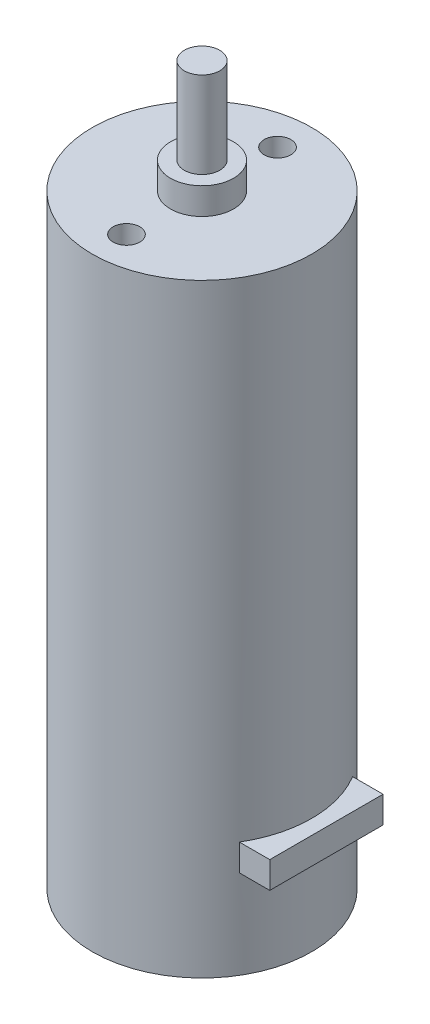
ISO-10303-21;
HEADER;
FILE_DESCRIPTION(('STEP AP214'),'2;1');
FILE_NAME('part.step','',(''),(''),'','','');
FILE_SCHEMA(('AUTOMOTIVE_DESIGN { 1 0 10303 214 1 1 1 1 }'));
ENDSEC;
DATA;
#1=APPLICATION_CONTEXT('core data for automotive mechanical design processes');
#2=APPLICATION_PROTOCOL_DEFINITION('international standard','automotive_design',2000,#1);
#3=PRODUCT_CONTEXT('',#1,'mechanical');
#4=PRODUCT('Part','Part','',(#3));
#5=PRODUCT_RELATED_PRODUCT_CATEGORY('part','',(#4));
#6=PRODUCT_DEFINITION_FORMATION('','',#4);
#7=PRODUCT_DEFINITION_CONTEXT('part definition',#1,'design');
#8=PRODUCT_DEFINITION('design','',#6,#7);
#9=PRODUCT_DEFINITION_SHAPE('','',#8);
#10=(LENGTH_UNIT() NAMED_UNIT(*) SI_UNIT(.MILLI.,.METRE.));
#11=(NAMED_UNIT(*) PLANE_ANGLE_UNIT() SI_UNIT($,.RADIAN.));
#12=(NAMED_UNIT(*) SI_UNIT($,.STERADIAN.) SOLID_ANGLE_UNIT());
#13=UNCERTAINTY_MEASURE_WITH_UNIT(LENGTH_MEASURE(1.E-05),#10,'distance_accuracy_value','');
#14=(GEOMETRIC_REPRESENTATION_CONTEXT(3) GLOBAL_UNCERTAINTY_ASSIGNED_CONTEXT((#13)) GLOBAL_UNIT_ASSIGNED_CONTEXT((#10,
#11,#12)) REPRESENTATION_CONTEXT('',''));
#15=CARTESIAN_POINT('',(0.,0.,0.));
#16=DIRECTION('',(0.,0.,1.));
#17=DIRECTION('',(1.,0.,0.));
#18=AXIS2_PLACEMENT_3D('',#15,#16,#17);
#19=CARTESIAN_POINT('',(0.,68.,0.));
#20=DIRECTION('',(0.,-1.,0.));
#21=DIRECTION('',(0.,0.,-1.));
#22=AXIS2_PLACEMENT_3D('',#19,#20,#21);
#23=CYLINDRICAL_SURFACE('',#22,12.35);
#24=CARTESIAN_POINT('',(0.,0.,0.));
#25=DIRECTION('',(0.,1.,0.));
#26=DIRECTION('',(0.,0.,1.));
#27=AXIS2_PLACEMENT_3D('',#24,#25,#26);
#28=CIRCLE('',#27,12.35);
#29=CARTESIAN_POINT('',(0.,0.,12.35));
#30=VERTEX_POINT('',#29);
#31=EDGE_CURVE('E118',#30,#30,#28,.T.);
#32=ORIENTED_EDGE('',*,*,#31,.T.);
#33=EDGE_LOOP('',(#32));
#34=FACE_BOUND('',#33,.T.);
#35=CARTESIAN_POINT('',(0.,68.,0.));
#36=DIRECTION('',(0.,1.,0.));
#37=DIRECTION('',(0.,0.,1.));
#38=AXIS2_PLACEMENT_3D('',#35,#36,#37);
#39=CIRCLE('',#38,12.35);
#40=CARTESIAN_POINT('',(0.,68.,12.35));
#41=VERTEX_POINT('',#40);
#42=EDGE_CURVE('E121',#41,#41,#39,.T.);
#43=ORIENTED_EDGE('',*,*,#42,.F.);
#44=EDGE_LOOP('',(#43));
#45=FACE_BOUND('',#44,.T.);
#46=DIRECTION('',(0.,-1.,0.));
#47=VECTOR('',#46,1.);
#48=CARTESIAN_POINT('',(10.5774228902885,68.,-6.37499999999999));
#49=LINE('',#48,#47);
#50=CARTESIAN_POINT('',(10.5774228902885,10.,-6.37499999999999));
#51=VERTEX_POINT('',#50);
#52=CARTESIAN_POINT('',(10.5774228902885,13.,-6.37499999999999));
#53=VERTEX_POINT('',#52);
#54=EDGE_CURVE('E11',#51,#53,#49,.F.);
#55=ORIENTED_EDGE('',*,*,#54,.F.);
#56=CARTESIAN_POINT('',(0.,10.,0.));
#57=DIRECTION('',(0.,1.,0.));
#58=DIRECTION('',(0.,0.,1.));
#59=AXIS2_PLACEMENT_3D('',#56,#57,#58);
#60=CIRCLE('',#59,12.35);
#61=CARTESIAN_POINT('',(10.5774228902885,10.,6.375));
#62=VERTEX_POINT('',#61);
#63=EDGE_CURVE('E114',#62,#51,#60,.T.);
#64=ORIENTED_EDGE('',*,*,#63,.F.);
#65=DIRECTION('',(0.,-1.,0.));
#66=VECTOR('',#65,1.);
#67=CARTESIAN_POINT('',(10.5774228902885,68.,6.375));
#68=LINE('',#67,#66);
#69=CARTESIAN_POINT('',(10.5774228902885,13.,6.375));
#70=VERTEX_POINT('',#69);
#71=EDGE_CURVE('E61',#70,#62,#68,.T.);
#72=ORIENTED_EDGE('',*,*,#71,.F.);
#73=CARTESIAN_POINT('',(0.,13.,0.));
#74=DIRECTION('',(0.,-1.,0.));
#75=DIRECTION('',(0.,0.,-1.));
#76=AXIS2_PLACEMENT_3D('',#73,#74,#75);
#77=CIRCLE('',#76,12.35);
#78=EDGE_CURVE('E51',#53,#70,#77,.T.);
#79=ORIENTED_EDGE('',*,*,#78,.F.);
#80=EDGE_LOOP('',(#55,#64,#72,#79));
#81=FACE_BOUND('',#80,.T.);
#82=ADVANCED_FACE('F44',(#34,#45,#81),#23,.T.);
#83=CARTESIAN_POINT('',(0.,68.,0.));
#84=DIRECTION('',(0.,1.,0.));
#85=DIRECTION('',(0.,0.,1.));
#86=AXIS2_PLACEMENT_3D('',#83,#84,#85);
#87=PLANE('',#86);
#88=CARTESIAN_POINT('',(0.,68.,-8.5));
#89=DIRECTION('',(0.,1.,0.));
#90=DIRECTION('',(0.,0.,1.));
#91=AXIS2_PLACEMENT_3D('',#88,#89,#90);
#92=CIRCLE('',#91,1.5);
#93=CARTESIAN_POINT('',(0.,68.,-7.));
#94=VERTEX_POINT('',#93);
#95=EDGE_CURVE('E201',#94,#94,#92,.T.);
#96=ORIENTED_EDGE('',*,*,#95,.F.);
#97=EDGE_LOOP('',(#96));
#98=FACE_BOUND('',#97,.T.);
#99=CARTESIAN_POINT('',(0.,68.,8.5));
#100=DIRECTION('',(0.,1.,0.));
#101=DIRECTION('',(0.,0.,1.));
#102=AXIS2_PLACEMENT_3D('',#99,#100,#101);
#103=CIRCLE('',#102,1.5);
#104=CARTESIAN_POINT('',(0.,68.,10.));
#105=VERTEX_POINT('',#104);
#106=EDGE_CURVE('E209',#105,#105,#103,.T.);
#107=ORIENTED_EDGE('',*,*,#106,.F.);
#108=EDGE_LOOP('',(#107));
#109=FACE_BOUND('',#108,.T.);
#110=CARTESIAN_POINT('',(0.,68.,0.));
#111=DIRECTION('',(0.,1.,0.));
#112=DIRECTION('',(0.,0.,1.));
#113=AXIS2_PLACEMENT_3D('',#110,#111,#112);
#114=CIRCLE('',#113,3.55);
#115=CARTESIAN_POINT('',(0.,68.,3.55));
#116=VERTEX_POINT('',#115);
#117=EDGE_CURVE('E115',#116,#116,#114,.T.);
#118=ORIENTED_EDGE('',*,*,#117,.F.);
#119=EDGE_LOOP('',(#118));
#120=FACE_BOUND('',#119,.T.);
#121=ORIENTED_EDGE('',*,*,#42,.T.);
#122=EDGE_LOOP('',(#121));
#123=FACE_BOUND('',#122,.T.);
#124=ADVANCED_FACE('F139',(#98,#109,#120,#123),#87,.T.);
#125=CARTESIAN_POINT('',(0.,0.,0.));
#126=DIRECTION('',(0.,1.,0.));
#127=DIRECTION('',(0.,0.,1.));
#128=AXIS2_PLACEMENT_3D('',#125,#126,#127);
#129=PLANE('',#128);
#130=ORIENTED_EDGE('',*,*,#31,.F.);
#131=EDGE_LOOP('',(#130));
#132=FACE_BOUND('',#131,.T.);
#133=ADVANCED_FACE('F146',(#132),#129,.F.);
#134=CARTESIAN_POINT('',(0.,71.,0.));
#135=DIRECTION('',(0.,-1.,0.));
#136=DIRECTION('',(0.,0.,-1.));
#137=AXIS2_PLACEMENT_3D('',#134,#135,#136);
#138=CYLINDRICAL_SURFACE('',#137,3.55);
#139=CARTESIAN_POINT('',(0.,71.,0.));
#140=DIRECTION('',(0.,1.,0.));
#141=DIRECTION('',(0.,0.,1.));
#142=AXIS2_PLACEMENT_3D('',#139,#140,#141);
#143=CIRCLE('',#142,3.55);
#144=CARTESIAN_POINT('',(0.,71.,3.55));
#145=VERTEX_POINT('',#144);
#146=EDGE_CURVE('E105',#145,#145,#143,.T.);
#147=ORIENTED_EDGE('',*,*,#146,.F.);
#148=EDGE_LOOP('',(#147));
#149=FACE_BOUND('',#148,.T.);
#150=ORIENTED_EDGE('',*,*,#117,.T.);
#151=EDGE_LOOP('',(#150));
#152=FACE_BOUND('',#151,.T.);
#153=ADVANCED_FACE('F155',(#149,#152),#138,.T.);
#154=CARTESIAN_POINT('',(0.,71.,0.));
#155=DIRECTION('',(0.,1.,0.));
#156=DIRECTION('',(0.,0.,1.));
#157=AXIS2_PLACEMENT_3D('',#154,#155,#156);
#158=PLANE('',#157);
#159=CARTESIAN_POINT('',(0.,71.,0.));
#160=DIRECTION('',(0.,1.,0.));
#161=DIRECTION('',(0.,0.,1.));
#162=AXIS2_PLACEMENT_3D('',#159,#160,#161);
#163=CIRCLE('',#162,2.);
#164=CARTESIAN_POINT('',(0.,71.,2.));
#165=VERTEX_POINT('',#164);
#166=EDGE_CURVE('E111',#165,#165,#163,.T.);
#167=ORIENTED_EDGE('',*,*,#166,.F.);
#168=EDGE_LOOP('',(#167));
#169=FACE_BOUND('',#168,.T.);
#170=ORIENTED_EDGE('',*,*,#146,.T.);
#171=EDGE_LOOP('',(#170));
#172=FACE_BOUND('',#171,.T.);
#173=ADVANCED_FACE('F159',(#169,#172),#158,.T.);
#174=CARTESIAN_POINT('',(0.,80.7,0.));
#175=DIRECTION('',(0.,-1.,0.));
#176=DIRECTION('',(0.,0.,-1.));
#177=AXIS2_PLACEMENT_3D('',#174,#175,#176);
#178=CYLINDRICAL_SURFACE('',#177,2.);
#179=CARTESIAN_POINT('',(0.,80.7,0.));
#180=DIRECTION('',(0.,1.,0.));
#181=DIRECTION('',(0.,0.,1.));
#182=AXIS2_PLACEMENT_3D('',#179,#180,#181);
#183=CIRCLE('',#182,2.);
#184=CARTESIAN_POINT('',(0.,80.7,2.));
#185=VERTEX_POINT('',#184);
#186=EDGE_CURVE('E102',#185,#185,#183,.T.);
#187=ORIENTED_EDGE('',*,*,#186,.F.);
#188=EDGE_LOOP('',(#187));
#189=FACE_BOUND('',#188,.T.);
#190=ORIENTED_EDGE('',*,*,#166,.T.);
#191=EDGE_LOOP('',(#190));
#192=FACE_BOUND('',#191,.T.);
#193=ADVANCED_FACE('F165',(#189,#192),#178,.T.);
#194=CARTESIAN_POINT('',(0.,80.7,0.));
#195=DIRECTION('',(0.,1.,0.));
#196=DIRECTION('',(0.,0.,1.));
#197=AXIS2_PLACEMENT_3D('',#194,#195,#196);
#198=PLANE('',#197);
#199=ORIENTED_EDGE('',*,*,#186,.T.);
#200=EDGE_LOOP('',(#199));
#201=FACE_BOUND('',#200,.T.);
#202=ADVANCED_FACE('F169',(#201),#198,.T.);
#203=CARTESIAN_POINT('',(14.,13.,-6.37499999999999));
#204=DIRECTION('',(0.,0.,1.));
#205=DIRECTION('',(1.,0.,0.));
#206=AXIS2_PLACEMENT_3D('',#203,#204,#205);
#207=PLANE('',#206);
#208=DIRECTION('',(-1.,0.,0.));
#209=VECTOR('',#208,1.);
#210=CARTESIAN_POINT('',(14.,10.,-6.37499999999999));
#211=LINE('',#210,#209);
#212=CARTESIAN_POINT('',(14.,10.,-6.37499999999999));
#213=VERTEX_POINT('',#212);
#214=EDGE_CURVE('E133',#213,#51,#211,.T.);
#215=ORIENTED_EDGE('',*,*,#214,.T.);
#216=ORIENTED_EDGE('',*,*,#54,.T.);
#217=DIRECTION('',(-1.,0.,0.));
#218=VECTOR('',#217,1.);
#219=CARTESIAN_POINT('',(14.,13.,-6.37499999999999));
#220=LINE('',#219,#218);
#221=CARTESIAN_POINT('',(14.,13.,-6.37499999999999));
#222=VERTEX_POINT('',#221);
#223=EDGE_CURVE('E84',#222,#53,#220,.T.);
#224=ORIENTED_EDGE('',*,*,#223,.F.);
#225=DIRECTION('',(0.,1.,0.));
#226=VECTOR('',#225,1.);
#227=CARTESIAN_POINT('',(14.,13.,-6.37499999999999));
#228=LINE('',#227,#226);
#229=EDGE_CURVE('E90',#213,#222,#228,.T.);
#230=ORIENTED_EDGE('',*,*,#229,.F.);
#231=EDGE_LOOP('',(#215,#216,#224,#230));
#232=FACE_BOUND('',#231,.T.);
#233=ADVANCED_FACE('F101',(#232),#207,.F.);
#234=CARTESIAN_POINT('',(14.,13.,6.375));
#235=DIRECTION('',(0.,0.,-1.));
#236=DIRECTION('',(-1.,0.,0.));
#237=AXIS2_PLACEMENT_3D('',#234,#235,#236);
#238=PLANE('',#237);
#239=DIRECTION('',(-1.,0.,0.));
#240=VECTOR('',#239,1.);
#241=CARTESIAN_POINT('',(14.,13.,6.375));
#242=LINE('',#241,#240);
#243=CARTESIAN_POINT('',(14.,13.,6.375));
#244=VERTEX_POINT('',#243);
#245=EDGE_CURVE('E86',#244,#70,#242,.T.);
#246=ORIENTED_EDGE('',*,*,#245,.T.);
#247=ORIENTED_EDGE('',*,*,#71,.T.);
#248=DIRECTION('',(-1.,0.,0.));
#249=VECTOR('',#248,1.);
#250=CARTESIAN_POINT('',(14.,10.,6.375));
#251=LINE('',#250,#249);
#252=CARTESIAN_POINT('',(14.,10.,6.375));
#253=VERTEX_POINT('',#252);
#254=EDGE_CURVE('E107',#253,#62,#251,.T.);
#255=ORIENTED_EDGE('',*,*,#254,.F.);
#256=DIRECTION('',(0.,-1.,0.));
#257=VECTOR('',#256,1.);
#258=CARTESIAN_POINT('',(14.,13.,6.375));
#259=LINE('',#258,#257);
#260=EDGE_CURVE('E89',#244,#253,#259,.T.);
#261=ORIENTED_EDGE('',*,*,#260,.F.);
#262=EDGE_LOOP('',(#246,#247,#255,#261));
#263=FACE_BOUND('',#262,.T.);
#264=ADVANCED_FACE('F129',(#263),#238,.F.);
#265=CARTESIAN_POINT('',(14.,13.,6.375));
#266=DIRECTION('',(0.,-1.,0.));
#267=DIRECTION('',(0.,0.,-1.));
#268=AXIS2_PLACEMENT_3D('',#265,#266,#267);
#269=PLANE('',#268);
#270=ORIENTED_EDGE('',*,*,#223,.T.);
#271=ORIENTED_EDGE('',*,*,#78,.T.);
#272=ORIENTED_EDGE('',*,*,#245,.F.);
#273=DIRECTION('',(0.,0.,1.));
#274=VECTOR('',#273,1.);
#275=CARTESIAN_POINT('',(14.,13.,6.375));
#276=LINE('',#275,#274);
#277=EDGE_CURVE('E80',#222,#244,#276,.T.);
#278=ORIENTED_EDGE('',*,*,#277,.F.);
#279=EDGE_LOOP('',(#270,#271,#272,#278));
#280=FACE_BOUND('',#279,.T.);
#281=ADVANCED_FACE('F82',(#280),#269,.F.);
#282=CARTESIAN_POINT('',(14.,10.,6.375));
#283=DIRECTION('',(0.,1.,0.));
#284=DIRECTION('',(0.,0.,1.));
#285=AXIS2_PLACEMENT_3D('',#282,#283,#284);
#286=PLANE('',#285);
#287=ORIENTED_EDGE('',*,*,#254,.T.);
#288=ORIENTED_EDGE('',*,*,#63,.T.);
#289=ORIENTED_EDGE('',*,*,#214,.F.);
#290=DIRECTION('',(0.,0.,-1.));
#291=VECTOR('',#290,1.);
#292=CARTESIAN_POINT('',(14.,10.,6.375));
#293=LINE('',#292,#291);
#294=EDGE_CURVE('E95',#253,#213,#293,.T.);
#295=ORIENTED_EDGE('',*,*,#294,.F.);
#296=EDGE_LOOP('',(#287,#288,#289,#295));
#297=FACE_BOUND('',#296,.T.);
#298=ADVANCED_FACE('F137',(#297),#286,.F.);
#299=CARTESIAN_POINT('',(14.,0.,0.));
#300=DIRECTION('',(1.,0.,0.));
#301=DIRECTION('',(0.,0.,-1.));
#302=AXIS2_PLACEMENT_3D('',#299,#300,#301);
#303=PLANE('',#302);
#304=ORIENTED_EDGE('',*,*,#229,.T.);
#305=ORIENTED_EDGE('',*,*,#277,.T.);
#306=ORIENTED_EDGE('',*,*,#260,.T.);
#307=ORIENTED_EDGE('',*,*,#294,.T.);
#308=EDGE_LOOP('',(#304,#305,#306,#307));
#309=FACE_BOUND('',#308,.T.);
#310=ADVANCED_FACE('F93',(#309),#303,.T.);
#311=CARTESIAN_POINT('',(0.,65.,8.5));
#312=DIRECTION('',(0.,1.,0.));
#313=DIRECTION('',(0.,0.,1.));
#314=AXIS2_PLACEMENT_3D('',#311,#312,#313);
#315=CYLINDRICAL_SURFACE('',#314,1.5);
#316=CARTESIAN_POINT('',(0.,65.,8.5));
#317=DIRECTION('',(0.,1.,0.));
#318=DIRECTION('',(0.,0.,1.));
#319=AXIS2_PLACEMENT_3D('',#316,#317,#318);
#320=CIRCLE('',#319,1.5);
#321=CARTESIAN_POINT('',(0.,65.,10.));
#322=VERTEX_POINT('',#321);
#323=EDGE_CURVE('E204',#322,#322,#320,.T.);
#324=ORIENTED_EDGE('',*,*,#323,.F.);
#325=EDGE_LOOP('',(#324));
#326=FACE_BOUND('',#325,.T.);
#327=ORIENTED_EDGE('',*,*,#106,.T.);
#328=EDGE_LOOP('',(#327));
#329=FACE_BOUND('',#328,.T.);
#330=ADVANCED_FACE('F182',(#326,#329),#315,.F.);
#331=CARTESIAN_POINT('',(0.,65.,0.));
#332=DIRECTION('',(0.,1.,0.));
#333=DIRECTION('',(0.,0.,1.));
#334=AXIS2_PLACEMENT_3D('',#331,#332,#333);
#335=PLANE('',#334);
#336=ORIENTED_EDGE('',*,*,#323,.T.);
#337=EDGE_LOOP('',(#336));
#338=FACE_BOUND('',#337,.T.);
#339=ADVANCED_FACE('F185',(#338),#335,.T.);
#340=CARTESIAN_POINT('',(0.,65.,-8.5));
#341=DIRECTION('',(0.,1.,0.));
#342=DIRECTION('',(0.,0.,1.));
#343=AXIS2_PLACEMENT_3D('',#340,#341,#342);
#344=CYLINDRICAL_SURFACE('',#343,1.5);
#345=CARTESIAN_POINT('',(0.,65.,-8.5));
#346=DIRECTION('',(0.,1.,0.));
#347=DIRECTION('',(0.,0.,1.));
#348=AXIS2_PLACEMENT_3D('',#345,#346,#347);
#349=CIRCLE('',#348,1.5);
#350=CARTESIAN_POINT('',(0.,65.,-7.));
#351=VERTEX_POINT('',#350);
#352=EDGE_CURVE('E99',#351,#351,#349,.T.);
#353=ORIENTED_EDGE('',*,*,#352,.F.);
#354=EDGE_LOOP('',(#353));
#355=FACE_BOUND('',#354,.T.);
#356=ORIENTED_EDGE('',*,*,#95,.T.);
#357=EDGE_LOOP('',(#356));
#358=FACE_BOUND('',#357,.T.);
#359=ADVANCED_FACE('F189',(#355,#358),#344,.F.);
#360=CARTESIAN_POINT('',(0.,65.,0.));
#361=DIRECTION('',(0.,1.,0.));
#362=DIRECTION('',(0.,0.,1.));
#363=AXIS2_PLACEMENT_3D('',#360,#361,#362);
#364=PLANE('',#363);
#365=ORIENTED_EDGE('',*,*,#352,.T.);
#366=EDGE_LOOP('',(#365));
#367=FACE_BOUND('',#366,.T.);
#368=ADVANCED_FACE('F193',(#367),#364,.T.);
#369=CLOSED_SHELL('',(#82,#124,#133,#153,#173,#193,#202,#233,#264,#281,#298,#310,#330,#339,#359,#368));
#370=MANIFOLD_SOLID_BREP('B2',#369);
#371=ADVANCED_BREP_SHAPE_REPRESENTATION('',(#18,#370),#14);
#372=SHAPE_DEFINITION_REPRESENTATION(#9,#371);
ENDSEC;
END-ISO-10303-21;
